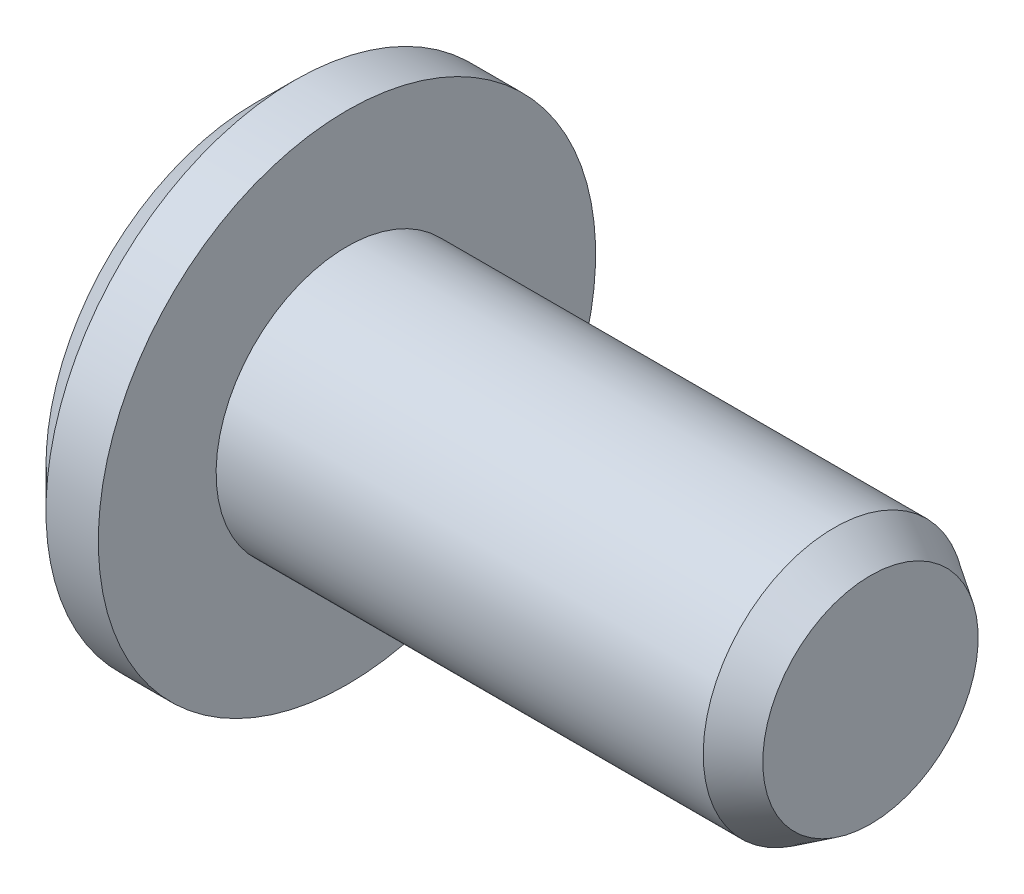
ISO-10303-21;
HEADER;
FILE_DESCRIPTION(('STEP AP214'),'2;1');
FILE_NAME('part.step','',(''),(''),'','','');
FILE_SCHEMA(('AUTOMOTIVE_DESIGN { 1 0 10303 214 1 1 1 1 }'));
ENDSEC;
DATA;
#1=APPLICATION_CONTEXT('core data for automotive mechanical design processes');
#2=APPLICATION_PROTOCOL_DEFINITION('international standard','automotive_design',2000,#1);
#3=PRODUCT_CONTEXT('',#1,'mechanical');
#4=PRODUCT('Part','Part','',(#3));
#5=PRODUCT_RELATED_PRODUCT_CATEGORY('part','',(#4));
#6=PRODUCT_DEFINITION_FORMATION('','',#4);
#7=PRODUCT_DEFINITION_CONTEXT('part definition',#1,'design');
#8=PRODUCT_DEFINITION('design','',#6,#7);
#9=PRODUCT_DEFINITION_SHAPE('','',#8);
#10=(LENGTH_UNIT() NAMED_UNIT(*) SI_UNIT(.MILLI.,.METRE.));
#11=(NAMED_UNIT(*) PLANE_ANGLE_UNIT() SI_UNIT($,.RADIAN.));
#12=(NAMED_UNIT(*) SI_UNIT($,.STERADIAN.) SOLID_ANGLE_UNIT());
#13=UNCERTAINTY_MEASURE_WITH_UNIT(LENGTH_MEASURE(1.E-05),#10,'distance_accuracy_value','');
#14=(GEOMETRIC_REPRESENTATION_CONTEXT(3) GLOBAL_UNCERTAINTY_ASSIGNED_CONTEXT((#13)) GLOBAL_UNIT_ASSIGNED_CONTEXT((#10,
#11,#12)) REPRESENTATION_CONTEXT('',''));
#15=CARTESIAN_POINT('',(0.,0.,0.));
#16=DIRECTION('',(0.,0.,1.));
#17=DIRECTION('',(1.,0.,0.));
#18=AXIS2_PLACEMENT_3D('',#15,#16,#17);
#19=CARTESIAN_POINT('',(11.75,0.,0.));
#20=DIRECTION('',(-1.,0.,0.));
#21=DIRECTION('',(0.,-1.,0.));
#22=AXIS2_PLACEMENT_3D('',#19,#20,#21);
#23=PLANE('',#22);
#24=CARTESIAN_POINT('',(11.75,0.,0.));
#25=DIRECTION('',(-1.,0.,0.));
#26=DIRECTION('',(0.,-1.,0.));
#27=AXIS2_PLACEMENT_3D('',#24,#25,#26);
#28=CIRCLE('',#27,2.0572361687388);
#29=CARTESIAN_POINT('',(11.75,-2.05723616873881,0.));
#30=VERTEX_POINT('',#29);
#31=EDGE_CURVE('E149',#30,#30,#28,.T.);
#32=ORIENTED_EDGE('',*,*,#31,.F.);
#33=EDGE_LOOP('',(#32));
#34=FACE_BOUND('',#33,.T.);
#35=ADVANCED_FACE('F33',(#34),#23,.F.);
#36=CARTESIAN_POINT('',(11.75,0.,0.));
#37=DIRECTION('',(-1.,0.,0.));
#38=DIRECTION('',(0.,-1.,0.));
#39=AXIS2_PLACEMENT_3D('',#36,#37,#38);
#40=CONICAL_SURFACE('',#39,2.0572361687388,0.567232006898159);
#41=CARTESIAN_POINT('',(11.055,0.,0.));
#42=DIRECTION('',(-1.,0.,0.));
#43=DIRECTION('',(0.,-1.,0.));
#44=AXIS2_PLACEMENT_3D('',#41,#42,#43);
#45=CIRCLE('',#44,2.50000000000002);
#46=CARTESIAN_POINT('',(11.055,-2.50000000000002,0.));
#47=VERTEX_POINT('',#46);
#48=EDGE_CURVE('E146',#47,#47,#45,.T.);
#49=ORIENTED_EDGE('',*,*,#48,.F.);
#50=EDGE_LOOP('',(#49));
#51=FACE_BOUND('',#50,.T.);
#52=ORIENTED_EDGE('',*,*,#31,.T.);
#53=EDGE_LOOP('',(#52));
#54=FACE_BOUND('',#53,.T.);
#55=ADVANCED_FACE('F166',(#51,#54),#40,.T.);
#56=CARTESIAN_POINT('',(0.,0.,0.));
#57=DIRECTION('',(-1.,0.,0.));
#58=DIRECTION('',(0.,-1.,0.));
#59=AXIS2_PLACEMENT_3D('',#56,#57,#58);
#60=CYLINDRICAL_SURFACE('',#59,2.50000000000002);
#61=CARTESIAN_POINT('',(1.75,0.,0.));
#62=DIRECTION('',(-1.,0.,0.));
#63=DIRECTION('',(0.,-1.,0.));
#64=AXIS2_PLACEMENT_3D('',#61,#62,#63);
#65=CIRCLE('',#64,2.50000000000002);
#66=CARTESIAN_POINT('',(1.75,-2.50000000000002,0.));
#67=VERTEX_POINT('',#66);
#68=EDGE_CURVE('E143',#67,#67,#65,.T.);
#69=ORIENTED_EDGE('',*,*,#68,.F.);
#70=EDGE_LOOP('',(#69));
#71=FACE_BOUND('',#70,.T.);
#72=ORIENTED_EDGE('',*,*,#48,.T.);
#73=EDGE_LOOP('',(#72));
#74=FACE_BOUND('',#73,.T.);
#75=ADVANCED_FACE('F171',(#71,#74),#60,.T.);
#76=CARTESIAN_POINT('',(1.75,2.50000000000002,0.));
#77=DIRECTION('',(-1.,0.,0.));
#78=DIRECTION('',(0.,-1.,0.));
#79=AXIS2_PLACEMENT_3D('',#76,#77,#78);
#80=PLANE('',#79);
#81=CARTESIAN_POINT('',(1.75,0.,0.));
#82=DIRECTION('',(-1.,0.,0.));
#83=DIRECTION('',(0.,-1.,0.));
#84=AXIS2_PLACEMENT_3D('',#81,#82,#83);
#85=CIRCLE('',#84,4.75000000000001);
#86=CARTESIAN_POINT('',(1.75,-4.75000000000001,0.));
#87=VERTEX_POINT('',#86);
#88=EDGE_CURVE('E135',#87,#87,#85,.T.);
#89=ORIENTED_EDGE('',*,*,#88,.F.);
#90=EDGE_LOOP('',(#89));
#91=FACE_BOUND('',#90,.T.);
#92=ORIENTED_EDGE('',*,*,#68,.T.);
#93=EDGE_LOOP('',(#92));
#94=FACE_BOUND('',#93,.T.);
#95=ADVANCED_FACE('F178',(#91,#94),#80,.F.);
#96=CARTESIAN_POINT('',(0.,0.,0.));
#97=DIRECTION('',(-1.,0.,0.));
#98=DIRECTION('',(0.,-1.,0.));
#99=AXIS2_PLACEMENT_3D('',#96,#97,#98);
#100=CYLINDRICAL_SURFACE('',#99,4.75000000000001);
#101=CARTESIAN_POINT('',(0.75,0.,0.));
#102=DIRECTION('',(1.,0.,0.));
#103=DIRECTION('',(0.,1.,0.));
#104=AXIS2_PLACEMENT_3D('',#101,#102,#103);
#105=CIRCLE('',#104,4.75000000000001);
#106=CARTESIAN_POINT('',(0.750000000000001,4.75000000000001,0.));
#107=VERTEX_POINT('',#106);
#108=EDGE_CURVE('E11',#107,#107,#105,.T.);
#109=ORIENTED_EDGE('',*,*,#108,.T.);
#110=EDGE_LOOP('',(#109));
#111=FACE_BOUND('',#110,.T.);
#112=ORIENTED_EDGE('',*,*,#88,.T.);
#113=EDGE_LOOP('',(#112));
#114=FACE_BOUND('',#113,.T.);
#115=ADVANCED_FACE('F182',(#111,#114),#100,.T.);
#116=CARTESIAN_POINT('',(0.,4.75000000000001,0.));
#117=DIRECTION('',(1.,0.,0.));
#118=DIRECTION('',(0.,1.,0.));
#119=AXIS2_PLACEMENT_3D('',#116,#117,#118);
#120=PLANE('',#119);
#121=CARTESIAN_POINT('',(0.,0.,0.));
#122=DIRECTION('',(1.,0.,0.));
#123=DIRECTION('',(0.,1.,0.));
#124=AXIS2_PLACEMENT_3D('',#121,#122,#123);
#125=CIRCLE('',#124,4.00000000000001);
#126=CARTESIAN_POINT('',(0.,4.00000000000001,0.));
#127=VERTEX_POINT('',#126);
#128=EDGE_CURVE('E41',#127,#127,#125,.F.);
#129=ORIENTED_EDGE('',*,*,#128,.T.);
#130=EDGE_LOOP('',(#129));
#131=FACE_BOUND('',#130,.T.);
#132=DIRECTION('',(0.,1.,0.));
#133=VECTOR('',#132,1.);
#134=CARTESIAN_POINT('',(0.,-0.866025403784439,1.5));
#135=LINE('',#134,#133);
#136=CARTESIAN_POINT('',(0.,-0.86602540378444,1.5));
#137=VERTEX_POINT('',#136);
#138=CARTESIAN_POINT('',(0.,0.86602540378444,1.5));
#139=VERTEX_POINT('',#138);
#140=EDGE_CURVE('E122',#137,#139,#135,.T.);
#141=ORIENTED_EDGE('',*,*,#140,.F.);
#142=DIRECTION('',(0.,0.5,0.866025403784439));
#143=VECTOR('',#142,1.);
#144=CARTESIAN_POINT('',(0.,-1.73205080756888,0.));
#145=LINE('',#144,#143);
#146=CARTESIAN_POINT('',(0.,-1.73205080756888,0.));
#147=VERTEX_POINT('',#146);
#148=EDGE_CURVE('E48',#147,#137,#145,.T.);
#149=ORIENTED_EDGE('',*,*,#148,.F.);
#150=DIRECTION('',(0.,-0.5,0.866025403784439));
#151=VECTOR('',#150,1.);
#152=CARTESIAN_POINT('',(0.,-0.866025403784439,-1.5));
#153=LINE('',#152,#151);
#154=CARTESIAN_POINT('',(0.,-0.866025403784439,-1.5));
#155=VERTEX_POINT('',#154);
#156=EDGE_CURVE('E131',#155,#147,#153,.T.);
#157=ORIENTED_EDGE('',*,*,#156,.F.);
#158=DIRECTION('',(0.,-1.,0.));
#159=VECTOR('',#158,1.);
#160=CARTESIAN_POINT('',(0.,0.86602540378444,-1.5));
#161=LINE('',#160,#159);
#162=CARTESIAN_POINT('',(0.,0.86602540378444,-1.5));
#163=VERTEX_POINT('',#162);
#164=EDGE_CURVE('E129',#163,#155,#161,.T.);
#165=ORIENTED_EDGE('',*,*,#164,.F.);
#166=DIRECTION('',(0.,-0.5,-0.866025403784439));
#167=VECTOR('',#166,1.);
#168=CARTESIAN_POINT('',(0.,1.73205080756888,0.));
#169=LINE('',#168,#167);
#170=CARTESIAN_POINT('',(0.,1.73205080756888,0.));
#171=VERTEX_POINT('',#170);
#172=EDGE_CURVE('E96',#171,#163,#169,.T.);
#173=ORIENTED_EDGE('',*,*,#172,.F.);
#174=DIRECTION('',(0.,0.5,-0.866025403784439));
#175=VECTOR('',#174,1.);
#176=CARTESIAN_POINT('',(0.,0.86602540378444,1.5));
#177=LINE('',#176,#175);
#178=EDGE_CURVE('E125',#139,#171,#177,.T.);
#179=ORIENTED_EDGE('',*,*,#178,.F.);
#180=EDGE_LOOP('',(#141,#149,#157,#165,#173,#179));
#181=FACE_BOUND('',#180,.T.);
#182=ADVANCED_FACE('F154',(#131,#181),#120,.F.);
#183=CARTESIAN_POINT('',(1.,-1.73205080756888,0.));
#184=DIRECTION('',(0.,-0.866025403784439,0.5));
#185=DIRECTION('',(0.,-0.5,-0.866025403784439));
#186=AXIS2_PLACEMENT_3D('',#183,#184,#185);
#187=PLANE('',#186);
#188=ORIENTED_EDGE('',*,*,#148,.T.);
#189=DIRECTION('',(-1.,0.,0.));
#190=VECTOR('',#189,1.);
#191=CARTESIAN_POINT('',(1.,-0.866025403784439,1.5));
#192=LINE('',#191,#190);
#193=CARTESIAN_POINT('',(1.,-0.866025403784439,1.5));
#194=VERTEX_POINT('',#193);
#195=EDGE_CURVE('E78',#194,#137,#192,.T.);
#196=ORIENTED_EDGE('',*,*,#195,.F.);
#197=DIRECTION('',(0.,0.5,0.866025403784439));
#198=VECTOR('',#197,1.);
#199=CARTESIAN_POINT('',(1.,-1.73205080756888,0.));
#200=LINE('',#199,#198);
#201=CARTESIAN_POINT('',(1.,-1.73205080756888,0.));
#202=VERTEX_POINT('',#201);
#203=EDGE_CURVE('E133',#202,#194,#200,.T.);
#204=ORIENTED_EDGE('',*,*,#203,.F.);
#205=DIRECTION('',(-1.,0.,0.));
#206=VECTOR('',#205,1.);
#207=CARTESIAN_POINT('',(1.,-1.73205080756888,0.));
#208=LINE('',#207,#206);
#209=EDGE_CURVE('E56',#202,#147,#208,.T.);
#210=ORIENTED_EDGE('',*,*,#209,.T.);
#211=EDGE_LOOP('',(#188,#196,#204,#210));
#212=FACE_BOUND('',#211,.T.);
#213=ADVANCED_FACE('F189',(#212),#187,.F.);
#214=CARTESIAN_POINT('',(1.,-0.866025403784439,-1.5));
#215=DIRECTION('',(0.,-0.866025403784439,-0.5));
#216=DIRECTION('',(0.,0.5,-0.866025403784439));
#217=AXIS2_PLACEMENT_3D('',#214,#215,#216);
#218=PLANE('',#217);
#219=ORIENTED_EDGE('',*,*,#156,.T.);
#220=ORIENTED_EDGE('',*,*,#209,.F.);
#221=DIRECTION('',(0.,-0.5,0.866025403784439));
#222=VECTOR('',#221,1.);
#223=CARTESIAN_POINT('',(1.,-0.866025403784439,-1.5));
#224=LINE('',#223,#222);
#225=CARTESIAN_POINT('',(1.,-0.866025403784439,-1.5));
#226=VERTEX_POINT('',#225);
#227=EDGE_CURVE('E108',#226,#202,#224,.T.);
#228=ORIENTED_EDGE('',*,*,#227,.F.);
#229=DIRECTION('',(-1.,0.,0.));
#230=VECTOR('',#229,1.);
#231=CARTESIAN_POINT('',(1.,-0.866025403784439,-1.5));
#232=LINE('',#231,#230);
#233=EDGE_CURVE('E100',#226,#155,#232,.T.);
#234=ORIENTED_EDGE('',*,*,#233,.T.);
#235=EDGE_LOOP('',(#219,#220,#228,#234));
#236=FACE_BOUND('',#235,.T.);
#237=ADVANCED_FACE('F192',(#236),#218,.F.);
#238=CARTESIAN_POINT('',(1.,0.86602540378444,-1.5));
#239=DIRECTION('',(0.,0.,-1.));
#240=DIRECTION('',(0.,1.,0.));
#241=AXIS2_PLACEMENT_3D('',#238,#239,#240);
#242=PLANE('',#241);
#243=ORIENTED_EDGE('',*,*,#164,.T.);
#244=ORIENTED_EDGE('',*,*,#233,.F.);
#245=DIRECTION('',(0.,-1.,0.));
#246=VECTOR('',#245,1.);
#247=CARTESIAN_POINT('',(1.,0.86602540378444,-1.5));
#248=LINE('',#247,#246);
#249=CARTESIAN_POINT('',(1.,0.86602540378444,-1.5));
#250=VERTEX_POINT('',#249);
#251=EDGE_CURVE('E104',#250,#226,#248,.T.);
#252=ORIENTED_EDGE('',*,*,#251,.F.);
#253=DIRECTION('',(-1.,0.,0.));
#254=VECTOR('',#253,1.);
#255=CARTESIAN_POINT('',(1.,0.86602540378444,-1.5));
#256=LINE('',#255,#254);
#257=EDGE_CURVE('E89',#250,#163,#256,.T.);
#258=ORIENTED_EDGE('',*,*,#257,.T.);
#259=EDGE_LOOP('',(#243,#244,#252,#258));
#260=FACE_BOUND('',#259,.T.);
#261=ADVANCED_FACE('F105',(#260),#242,.F.);
#262=CARTESIAN_POINT('',(1.,1.73205080756888,0.));
#263=DIRECTION('',(0.,0.866025403784439,-0.5));
#264=DIRECTION('',(0.,0.5,0.866025403784439));
#265=AXIS2_PLACEMENT_3D('',#262,#263,#264);
#266=PLANE('',#265);
#267=ORIENTED_EDGE('',*,*,#172,.T.);
#268=ORIENTED_EDGE('',*,*,#257,.F.);
#269=DIRECTION('',(0.,-0.5,-0.866025403784439));
#270=VECTOR('',#269,1.);
#271=CARTESIAN_POINT('',(1.,1.73205080756888,0.));
#272=LINE('',#271,#270);
#273=CARTESIAN_POINT('',(1.,1.73205080756888,0.));
#274=VERTEX_POINT('',#273);
#275=EDGE_CURVE('E93',#274,#250,#272,.T.);
#276=ORIENTED_EDGE('',*,*,#275,.F.);
#277=DIRECTION('',(-1.,0.,0.));
#278=VECTOR('',#277,1.);
#279=CARTESIAN_POINT('',(1.,1.73205080756888,0.));
#280=LINE('',#279,#278);
#281=EDGE_CURVE('E101',#274,#171,#280,.T.);
#282=ORIENTED_EDGE('',*,*,#281,.T.);
#283=EDGE_LOOP('',(#267,#268,#276,#282));
#284=FACE_BOUND('',#283,.T.);
#285=ADVANCED_FACE('F91',(#284),#266,.F.);
#286=CARTESIAN_POINT('',(1.,0.86602540378444,1.5));
#287=DIRECTION('',(0.,0.866025403784439,0.5));
#288=DIRECTION('',(0.,-0.5,0.866025403784439));
#289=AXIS2_PLACEMENT_3D('',#286,#287,#288);
#290=PLANE('',#289);
#291=ORIENTED_EDGE('',*,*,#178,.T.);
#292=ORIENTED_EDGE('',*,*,#281,.F.);
#293=DIRECTION('',(0.,0.5,-0.866025403784439));
#294=VECTOR('',#293,1.);
#295=CARTESIAN_POINT('',(1.,0.86602540378444,1.5));
#296=LINE('',#295,#294);
#297=CARTESIAN_POINT('',(1.,0.86602540378444,1.5));
#298=VERTEX_POINT('',#297);
#299=EDGE_CURVE('E114',#298,#274,#296,.T.);
#300=ORIENTED_EDGE('',*,*,#299,.F.);
#301=DIRECTION('',(-1.,0.,0.));
#302=VECTOR('',#301,1.);
#303=CARTESIAN_POINT('',(1.,0.86602540378444,1.5));
#304=LINE('',#303,#302);
#305=EDGE_CURVE('E138',#298,#139,#304,.T.);
#306=ORIENTED_EDGE('',*,*,#305,.T.);
#307=EDGE_LOOP('',(#291,#292,#300,#306));
#308=FACE_BOUND('',#307,.T.);
#309=ADVANCED_FACE('F195',(#308),#290,.F.);
#310=CARTESIAN_POINT('',(1.,-0.866025403784439,1.5));
#311=DIRECTION('',(0.,0.,1.));
#312=DIRECTION('',(0.,-1.,0.));
#313=AXIS2_PLACEMENT_3D('',#310,#311,#312);
#314=PLANE('',#313);
#315=ORIENTED_EDGE('',*,*,#140,.T.);
#316=ORIENTED_EDGE('',*,*,#305,.F.);
#317=DIRECTION('',(0.,1.,0.));
#318=VECTOR('',#317,1.);
#319=CARTESIAN_POINT('',(1.,-0.866025403784439,1.5));
#320=LINE('',#319,#318);
#321=EDGE_CURVE('E116',#194,#298,#320,.T.);
#322=ORIENTED_EDGE('',*,*,#321,.F.);
#323=ORIENTED_EDGE('',*,*,#195,.T.);
#324=EDGE_LOOP('',(#315,#316,#322,#323));
#325=FACE_BOUND('',#324,.T.);
#326=ADVANCED_FACE('F162',(#325),#314,.F.);
#327=CARTESIAN_POINT('',(1.,0.,0.));
#328=DIRECTION('',(-1.,0.,0.));
#329=DIRECTION('',(0.,-1.,0.));
#330=AXIS2_PLACEMENT_3D('',#327,#328,#329);
#331=PLANE('',#330);
#332=ORIENTED_EDGE('',*,*,#203,.T.);
#333=ORIENTED_EDGE('',*,*,#321,.T.);
#334=ORIENTED_EDGE('',*,*,#299,.T.);
#335=ORIENTED_EDGE('',*,*,#275,.T.);
#336=ORIENTED_EDGE('',*,*,#251,.T.);
#337=ORIENTED_EDGE('',*,*,#227,.T.);
#338=EDGE_LOOP('',(#332,#333,#334,#335,#336,#337));
#339=FACE_BOUND('',#338,.T.);
#340=ADVANCED_FACE('F111',(#339),#331,.T.);
#341=CARTESIAN_POINT('',(0.,0.,0.));
#342=DIRECTION('',(1.,0.,0.));
#343=DIRECTION('',(0.,1.,0.));
#344=AXIS2_PLACEMENT_3D('',#341,#342,#343);
#345=CONICAL_SURFACE('',#344,4.00000000000001,0.785398163397447);
#346=ORIENTED_EDGE('',*,*,#108,.F.);
#347=EDGE_LOOP('',(#346));
#348=FACE_BOUND('',#347,.T.);
#349=ORIENTED_EDGE('',*,*,#128,.F.);
#350=EDGE_LOOP('',(#349));
#351=FACE_BOUND('',#350,.T.);
#352=ADVANCED_FACE('F35',(#348,#351),#345,.T.);
#353=CLOSED_SHELL('',(#35,#55,#75,#95,#115,#182,#213,#237,#261,#285,#309,#326,#340,#352));
#354=MANIFOLD_SOLID_BREP('B2',#353);
#355=ADVANCED_BREP_SHAPE_REPRESENTATION('',(#18,#354),#14);
#356=SHAPE_DEFINITION_REPRESENTATION(#9,#355);
ENDSEC;
END-ISO-10303-21;
